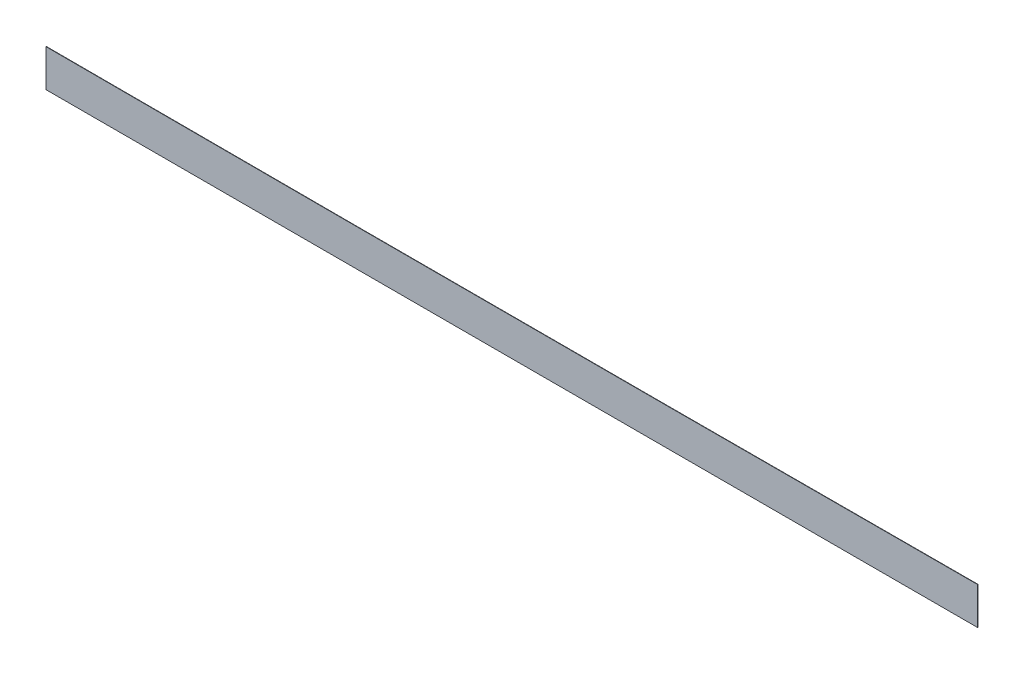
ISO-10303-21;
HEADER;
FILE_DESCRIPTION(('STEP AP214'),'2;1');
FILE_NAME('part.step','',(''),(''),'','','');
FILE_SCHEMA(('AUTOMOTIVE_DESIGN { 1 0 10303 214 1 1 1 1 }'));
ENDSEC;
DATA;
#1=APPLICATION_CONTEXT('core data for automotive mechanical design processes');
#2=APPLICATION_PROTOCOL_DEFINITION('international standard','automotive_design',2000,#1);
#3=PRODUCT_CONTEXT('',#1,'mechanical');
#4=PRODUCT('Part','Part','',(#3));
#5=PRODUCT_RELATED_PRODUCT_CATEGORY('part','',(#4));
#6=PRODUCT_DEFINITION_FORMATION('','',#4);
#7=PRODUCT_DEFINITION_CONTEXT('part definition',#1,'design');
#8=PRODUCT_DEFINITION('design','',#6,#7);
#9=PRODUCT_DEFINITION_SHAPE('','',#8);
#10=(LENGTH_UNIT() NAMED_UNIT(*) SI_UNIT(.MILLI.,.METRE.));
#11=(NAMED_UNIT(*) PLANE_ANGLE_UNIT() SI_UNIT($,.RADIAN.));
#12=(NAMED_UNIT(*) SI_UNIT($,.STERADIAN.) SOLID_ANGLE_UNIT());
#13=UNCERTAINTY_MEASURE_WITH_UNIT(LENGTH_MEASURE(1.E-05),#10,'distance_accuracy_value','');
#14=(GEOMETRIC_REPRESENTATION_CONTEXT(3) GLOBAL_UNCERTAINTY_ASSIGNED_CONTEXT((#13)) GLOBAL_UNIT_ASSIGNED_CONTEXT((#10,
#11,#12)) REPRESENTATION_CONTEXT('',''));
#15=CARTESIAN_POINT('',(0.,0.,0.));
#16=DIRECTION('',(0.,0.,1.));
#17=DIRECTION('',(1.,0.,0.));
#18=AXIS2_PLACEMENT_3D('',#15,#16,#17);
#19=CARTESIAN_POINT('',(0.,520932.583333333,1.));
#20=DIRECTION('',(0.,0.,-1.));
#21=DIRECTION('',(-1.,0.,0.));
#22=AXIS2_PLACEMENT_3D('',#19,#20,#21);
#23=CYLINDRICAL_SURFACE('',#22,520834.083333333);
#24=CARTESIAN_POINT('',(0.,520932.583333333,0.));
#25=DIRECTION('',(0.,0.,-1.));
#26=DIRECTION('',(1.,0.,0.));
#27=AXIS2_PLACEMENT_3D('',#24,#25,#26);
#28=CIRCLE('',#27,520834.083333333);
#29=CARTESIAN_POINT('',(1250.,100.,0.));
#30=VERTEX_POINT('',#29);
#31=CARTESIAN_POINT('',(-1250.,100.,0.));
#32=VERTEX_POINT('',#31);
#33=EDGE_CURVE('E97',#30,#32,#28,.T.);
#34=ORIENTED_EDGE('',*,*,#33,.T.);
#35=DIRECTION('',(0.,0.,-1.));
#36=VECTOR('',#35,1.);
#37=CARTESIAN_POINT('',(-1250.,100.,1.));
#38=LINE('',#37,#36);
#39=CARTESIAN_POINT('',(-1250.,100.,1.));
#40=VERTEX_POINT('',#39);
#41=EDGE_CURVE('E11',#40,#32,#38,.T.);
#42=ORIENTED_EDGE('',*,*,#41,.F.);
#43=CARTESIAN_POINT('',(0.,520932.583333333,1.));
#44=DIRECTION('',(0.,0.,-1.));
#45=DIRECTION('',(1.,0.,0.));
#46=AXIS2_PLACEMENT_3D('',#43,#44,#45);
#47=CIRCLE('',#46,520834.083333333);
#48=CARTESIAN_POINT('',(1250.,100.,1.));
#49=VERTEX_POINT('',#48);
#50=EDGE_CURVE('E85',#49,#40,#47,.T.);
#51=ORIENTED_EDGE('',*,*,#50,.F.);
#52=DIRECTION('',(0.,0.,-1.));
#53=VECTOR('',#52,1.);
#54=CARTESIAN_POINT('',(1250.,100.,1.));
#55=LINE('',#54,#53);
#56=EDGE_CURVE('E93',#49,#30,#55,.T.);
#57=ORIENTED_EDGE('',*,*,#56,.T.);
#58=EDGE_LOOP('',(#34,#42,#51,#57));
#59=FACE_BOUND('',#58,.T.);
#60=ADVANCED_FACE('F34',(#59),#23,.F.);
#61=CARTESIAN_POINT('',(-1250.,100.,1.));
#62=DIRECTION('',(1.,0.,0.));
#63=DIRECTION('',(0.,0.,-1.));
#64=AXIS2_PLACEMENT_3D('',#61,#62,#63);
#65=PLANE('',#64);
#66=DIRECTION('',(0.,-1.,0.));
#67=VECTOR('',#66,1.);
#68=CARTESIAN_POINT('',(-1250.,100.,0.));
#69=LINE('',#68,#67);
#70=CARTESIAN_POINT('',(-1250.,0.,0.));
#71=VERTEX_POINT('',#70);
#72=EDGE_CURVE('E89',#32,#71,#69,.T.);
#73=ORIENTED_EDGE('',*,*,#72,.T.);
#74=DIRECTION('',(0.,0.,-1.));
#75=VECTOR('',#74,1.);
#76=CARTESIAN_POINT('',(-1250.,0.,1.));
#77=LINE('',#76,#75);
#78=CARTESIAN_POINT('',(-1250.,0.,1.));
#79=VERTEX_POINT('',#78);
#80=EDGE_CURVE('E42',#79,#71,#77,.T.);
#81=ORIENTED_EDGE('',*,*,#80,.F.);
#82=DIRECTION('',(0.,-1.,0.));
#83=VECTOR('',#82,1.);
#84=CARTESIAN_POINT('',(-1250.,100.,1.));
#85=LINE('',#84,#83);
#86=EDGE_CURVE('E80',#40,#79,#85,.T.);
#87=ORIENTED_EDGE('',*,*,#86,.F.);
#88=ORIENTED_EDGE('',*,*,#41,.T.);
#89=EDGE_LOOP('',(#73,#81,#87,#88));
#90=FACE_BOUND('',#89,.T.);
#91=ADVANCED_FACE('F88',(#90),#65,.F.);
#92=CARTESIAN_POINT('',(-1250.,0.,1.));
#93=DIRECTION('',(0.,1.,0.));
#94=DIRECTION('',(0.,0.,1.));
#95=AXIS2_PLACEMENT_3D('',#92,#93,#94);
#96=PLANE('',#95);
#97=DIRECTION('',(1.,0.,0.));
#98=VECTOR('',#97,1.);
#99=CARTESIAN_POINT('',(-1250.,0.,0.));
#100=LINE('',#99,#98);
#101=CARTESIAN_POINT('',(1250.,0.,0.));
#102=VERTEX_POINT('',#101);
#103=EDGE_CURVE('E67',#71,#102,#100,.T.);
#104=ORIENTED_EDGE('',*,*,#103,.T.);
#105=DIRECTION('',(0.,0.,-1.));
#106=VECTOR('',#105,1.);
#107=CARTESIAN_POINT('',(1250.,0.,1.));
#108=LINE('',#107,#106);
#109=CARTESIAN_POINT('',(1250.,0.,1.));
#110=VERTEX_POINT('',#109);
#111=EDGE_CURVE('E90',#110,#102,#108,.T.);
#112=ORIENTED_EDGE('',*,*,#111,.F.);
#113=DIRECTION('',(1.,0.,0.));
#114=VECTOR('',#113,1.);
#115=CARTESIAN_POINT('',(-1250.,0.,1.));
#116=LINE('',#115,#114);
#117=EDGE_CURVE('E83',#79,#110,#116,.T.);
#118=ORIENTED_EDGE('',*,*,#117,.F.);
#119=ORIENTED_EDGE('',*,*,#80,.T.);
#120=EDGE_LOOP('',(#104,#112,#118,#119));
#121=FACE_BOUND('',#120,.T.);
#122=ADVANCED_FACE('F91',(#121),#96,.F.);
#123=CARTESIAN_POINT('',(1250.,100.,1.));
#124=DIRECTION('',(-1.,0.,0.));
#125=DIRECTION('',(0.,0.,1.));
#126=AXIS2_PLACEMENT_3D('',#123,#124,#125);
#127=PLANE('',#126);
#128=DIRECTION('',(0.,1.,0.));
#129=VECTOR('',#128,1.);
#130=CARTESIAN_POINT('',(1250.,100.,0.));
#131=LINE('',#130,#129);
#132=EDGE_CURVE('E73',#102,#30,#131,.T.);
#133=ORIENTED_EDGE('',*,*,#132,.T.);
#134=ORIENTED_EDGE('',*,*,#56,.F.);
#135=DIRECTION('',(0.,1.,0.));
#136=VECTOR('',#135,1.);
#137=CARTESIAN_POINT('',(1250.,100.,1.));
#138=LINE('',#137,#136);
#139=EDGE_CURVE('E50',#110,#49,#138,.T.);
#140=ORIENTED_EDGE('',*,*,#139,.F.);
#141=ORIENTED_EDGE('',*,*,#111,.T.);
#142=EDGE_LOOP('',(#133,#134,#140,#141));
#143=FACE_BOUND('',#142,.T.);
#144=ADVANCED_FACE('F104',(#143),#127,.F.);
#145=CARTESIAN_POINT('',(0.,520932.583333333,1.));
#146=DIRECTION('',(0.,0.,1.));
#147=DIRECTION('',(1.,0.,0.));
#148=AXIS2_PLACEMENT_3D('',#145,#146,#147);
#149=PLANE('',#148);
#150=ORIENTED_EDGE('',*,*,#50,.T.);
#151=ORIENTED_EDGE('',*,*,#86,.T.);
#152=ORIENTED_EDGE('',*,*,#117,.T.);
#153=ORIENTED_EDGE('',*,*,#139,.T.);
#154=EDGE_LOOP('',(#150,#151,#152,#153));
#155=FACE_BOUND('',#154,.T.);
#156=ADVANCED_FACE('F81',(#155),#149,.T.);
#157=CARTESIAN_POINT('',(0.,520932.583333333,0.));
#158=DIRECTION('',(0.,0.,1.));
#159=DIRECTION('',(1.,0.,0.));
#160=AXIS2_PLACEMENT_3D('',#157,#158,#159);
#161=PLANE('',#160);
#162=ORIENTED_EDGE('',*,*,#33,.F.);
#163=ORIENTED_EDGE('',*,*,#132,.F.);
#164=ORIENTED_EDGE('',*,*,#103,.F.);
#165=ORIENTED_EDGE('',*,*,#72,.F.);
#166=EDGE_LOOP('',(#162,#163,#164,#165));
#167=FACE_BOUND('',#166,.T.);
#168=ADVANCED_FACE('F107',(#167),#161,.F.);
#169=CLOSED_SHELL('',(#60,#91,#122,#144,#156,#168));
#170=MANIFOLD_SOLID_BREP('B2',#169);
#171=ADVANCED_BREP_SHAPE_REPRESENTATION('',(#18,#170),#14);
#172=SHAPE_DEFINITION_REPRESENTATION(#9,#171);
ENDSEC;
END-ISO-10303-21;
